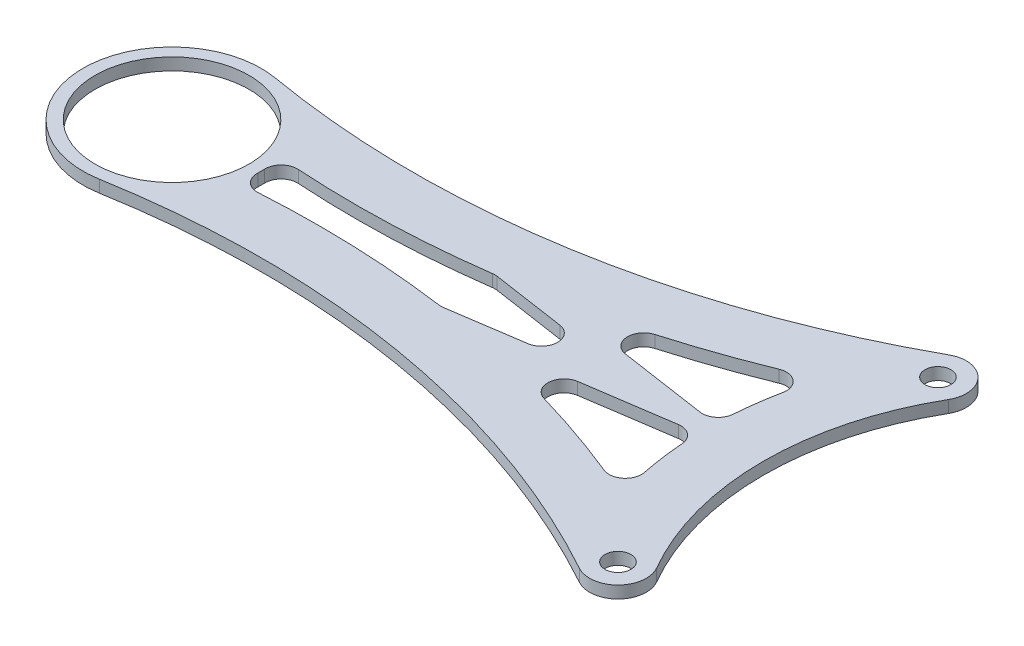
ISO-10303-21;
HEADER;
FILE_DESCRIPTION(('STEP AP214'),'2;1');
FILE_NAME('part.step','',(''),(''),'','','');
FILE_SCHEMA(('AUTOMOTIVE_DESIGN { 1 0 10303 214 1 1 1 1 }'));
ENDSEC;
DATA;
#1=APPLICATION_CONTEXT('core data for automotive mechanical design processes');
#2=APPLICATION_PROTOCOL_DEFINITION('international standard','automotive_design',2000,#1);
#3=PRODUCT_CONTEXT('',#1,'mechanical');
#4=PRODUCT('Part','Part','',(#3));
#5=PRODUCT_RELATED_PRODUCT_CATEGORY('part','',(#4));
#6=PRODUCT_DEFINITION_FORMATION('','',#4);
#7=PRODUCT_DEFINITION_CONTEXT('part definition',#1,'design');
#8=PRODUCT_DEFINITION('design','',#6,#7);
#9=PRODUCT_DEFINITION_SHAPE('','',#8);
#10=(LENGTH_UNIT() NAMED_UNIT(*) SI_UNIT(.MILLI.,.METRE.));
#11=(NAMED_UNIT(*) PLANE_ANGLE_UNIT() SI_UNIT($,.RADIAN.));
#12=(NAMED_UNIT(*) SI_UNIT($,.STERADIAN.) SOLID_ANGLE_UNIT());
#13=UNCERTAINTY_MEASURE_WITH_UNIT(LENGTH_MEASURE(1.E-05),#10,'distance_accuracy_value','');
#14=(GEOMETRIC_REPRESENTATION_CONTEXT(3) GLOBAL_UNCERTAINTY_ASSIGNED_CONTEXT((#13)) GLOBAL_UNIT_ASSIGNED_CONTEXT((#10,
#11,#12)) REPRESENTATION_CONTEXT('',''));
#15=CARTESIAN_POINT('',(0.,0.,0.));
#16=DIRECTION('',(0.,0.,1.));
#17=DIRECTION('',(1.,0.,0.));
#18=AXIS2_PLACEMENT_3D('',#15,#16,#17);
#19=CARTESIAN_POINT('',(0.,0.75,0.));
#20=DIRECTION('',(0.,1.,0.));
#21=DIRECTION('',(0.,0.,1.));
#22=AXIS2_PLACEMENT_3D('',#19,#20,#21);
#23=PLANE('',#22);
#24=CARTESIAN_POINT('',(-109.,0.75,0.));
#25=DIRECTION('',(0.,1.,0.));
#26=DIRECTION('',(0.,0.,1.));
#27=AXIS2_PLACEMENT_3D('',#24,#25,#26);
#28=CIRCLE('',#27,9.49999999999999);
#29=CARTESIAN_POINT('',(-109.,0.75,9.50000000000002));
#30=VERTEX_POINT('',#29);
#31=EDGE_CURVE('E789',#30,#30,#28,.T.);
#32=ORIENTED_EDGE('',*,*,#31,.F.);
#33=EDGE_LOOP('',(#32));
#34=FACE_BOUND('',#33,.T.);
#35=DIRECTION('',(-0.989134239046826,0.,-0.147015159576339));
#36=VECTOR('',#35,1.);
#37=CARTESIAN_POINT('',(-0.782363497669689,0.75,5.26382806477644));
#38=LINE('',#37,#36);
#39=CARTESIAN_POINT('',(-45.1719776825577,0.75,-1.33380646783477));
#40=VERTEX_POINT('',#39);
#41=CARTESIAN_POINT('',(-55.9833992617867,0.75,-2.94070956144224));
#42=VERTEX_POINT('',#41);
#43=EDGE_CURVE('E454',#40,#42,#38,.T.);
#44=ORIENTED_EDGE('',*,*,#43,.T.);
#45=CARTESIAN_POINT('',(-55.689368942634,0.75,-4.91897803953589));
#46=DIRECTION('',(0.,1.,0.));
#47=DIRECTION('',(0.,0.,1.));
#48=AXIS2_PLACEMENT_3D('',#45,#46,#47);
#49=CIRCLE('',#48,2.);
#50=CARTESIAN_POINT('',(-56.2465663827674,0.75,-6.83979323437083));
#51=VERTEX_POINT('',#50);
#52=EDGE_CURVE('E405',#42,#51,#49,.F.);
#53=ORIENTED_EDGE('',*,*,#52,.T.);
#54=CARTESIAN_POINT('',(-88.5640179105055,0.75,-118.247074534797));
#55=DIRECTION('',(0.,1.,0.));
#56=DIRECTION('',(0.,0.,1.));
#57=AXIS2_PLACEMENT_3D('',#54,#55,#56);
#58=CIRCLE('',#57,116.);
#59=CARTESIAN_POINT('',(-44.855784822336,0.75,-10.7966656928096));
#60=VERTEX_POINT('',#59);
#61=EDGE_CURVE('E821',#51,#60,#58,.T.);
#62=ORIENTED_EDGE('',*,*,#61,.T.);
#63=CARTESIAN_POINT('',(-44.1021945966779,0.75,-8.9440724369133));
#64=DIRECTION('',(0.,1.,0.));
#65=DIRECTION('',(0.,0.,1.));
#66=AXIS2_PLACEMENT_3D('',#63,#64,#65);
#67=CIRCLE('',#66,2.);
#68=CARTESIAN_POINT('',(-42.1420970590478,0.75,-8.54655810638382));
#69=VERTEX_POINT('',#68);
#70=EDGE_CURVE('E397',#60,#69,#67,.F.);
#71=ORIENTED_EDGE('',*,*,#70,.T.);
#72=CARTESIAN_POINT('',(0.,0.75,0.));
#73=DIRECTION('',(0.,1.,0.));
#74=DIRECTION('',(0.,0.,1.));
#75=AXIS2_PLACEMENT_3D('',#72,#73,#74);
#76=CIRCLE('',#75,43.);
#77=CARTESIAN_POINT('',(-42.8833719250315,0.75,-3.16487161499827));
#78=VERTEX_POINT('',#77);
#79=EDGE_CURVE('E804',#69,#78,#76,.T.);
#80=ORIENTED_EDGE('',*,*,#79,.T.);
#81=CARTESIAN_POINT('',(-44.877947363405,0.75,-3.31207494592842));
#82=DIRECTION('',(0.,1.,0.));
#83=DIRECTION('',(0.,0.,1.));
#84=AXIS2_PLACEMENT_3D('',#81,#82,#83);
#85=CIRCLE('',#84,2.);
#86=EDGE_CURVE('E393',#78,#40,#85,.F.);
#87=ORIENTED_EDGE('',*,*,#86,.T.);
#88=EDGE_LOOP('',(#44,#53,#62,#71,#80,#87));
#89=FACE_BOUND('',#88,.T.);
#90=CARTESIAN_POINT('',(0.,0.75,0.));
#91=DIRECTION('',(0.,1.,0.));
#92=DIRECTION('',(0.,0.,1.));
#93=AXIS2_PLACEMENT_3D('',#90,#91,#92);
#94=CIRCLE('',#93,36.);
#95=CARTESIAN_POINT('',(-31.1769145362398,0.75,-18.));
#96=VERTEX_POINT('',#95);
#97=CARTESIAN_POINT('',(-31.1769145362398,0.75,18.));
#98=VERTEX_POINT('',#97);
#99=EDGE_CURVE('E280',#96,#98,#94,.T.);
#100=ORIENTED_EDGE('',*,*,#99,.F.);
#101=CARTESIAN_POINT('',(-34.2080034494853,0.75,-19.75));
#102=DIRECTION('',(0.,1.,0.));
#103=DIRECTION('',(0.,0.,1.));
#104=AXIS2_PLACEMENT_3D('',#101,#102,#103);
#105=CIRCLE('',#104,3.5);
#106=CARTESIAN_POINT('',(-35.8990794549393,0.75,-22.8143534299715));
#107=VERTEX_POINT('',#106);
#108=EDGE_CURVE('E290',#96,#107,#105,.T.);
#109=ORIENTED_EDGE('',*,*,#108,.T.);
#110=CARTESIAN_POINT('',(-88.5640179105055,0.75,-118.247074534797));
#111=DIRECTION('',(0.,1.,0.));
#112=DIRECTION('',(0.,0.,1.));
#113=AXIS2_PLACEMENT_3D('',#110,#111,#112);
#114=CIRCLE('',#113,109.);
#115=CARTESIAN_POINT('',(-107.126701641796,0.75,-10.8393151656897));
#116=VERTEX_POINT('',#115);
#117=EDGE_CURVE('E295',#116,#107,#114,.T.);
#118=ORIENTED_EDGE('',*,*,#117,.F.);
#119=CARTESIAN_POINT('',(-109.,0.75,0.));
#120=DIRECTION('',(0.,1.,0.));
#121=DIRECTION('',(0.,0.,1.));
#122=AXIS2_PLACEMENT_3D('',#119,#120,#121);
#123=CIRCLE('',#122,11.);
#124=CARTESIAN_POINT('',(-107.126701641796,0.75,10.8393151656897));
#125=VERTEX_POINT('',#124);
#126=EDGE_CURVE('E311',#116,#125,#123,.T.);
#127=ORIENTED_EDGE('',*,*,#126,.T.);
#128=CARTESIAN_POINT('',(-88.5640179105054,0.75,118.247074534797));
#129=DIRECTION('',(0.,1.,0.));
#130=DIRECTION('',(0.,0.,1.));
#131=AXIS2_PLACEMENT_3D('',#128,#129,#130);
#132=CIRCLE('',#131,109.);
#133=CARTESIAN_POINT('',(-35.8990794549393,0.75,22.8143534299715));
#134=VERTEX_POINT('',#133);
#135=EDGE_CURVE('E313',#125,#134,#132,.F.);
#136=ORIENTED_EDGE('',*,*,#135,.T.);
#137=CARTESIAN_POINT('',(-34.2080034494853,0.75,19.7500000000001));
#138=DIRECTION('',(0.,1.,0.));
#139=DIRECTION('',(0.,0.,1.));
#140=AXIS2_PLACEMENT_3D('',#137,#138,#139);
#141=CIRCLE('',#140,3.5);
#142=EDGE_CURVE('E299',#134,#98,#141,.T.);
#143=ORIENTED_EDGE('',*,*,#142,.T.);
#144=EDGE_LOOP('',(#100,#109,#118,#127,#136,#143));
#145=FACE_BOUND('',#144,.T.);
#146=CARTESIAN_POINT('',(-34.2080034494853,0.75,19.7500000000001));
#147=DIRECTION('',(0.,1.,0.));
#148=DIRECTION('',(0.,0.,1.));
#149=AXIS2_PLACEMENT_3D('',#146,#147,#148);
#150=CIRCLE('',#149,1.6);
#151=CARTESIAN_POINT('',(-34.2080034494853,0.75,21.3500000000001));
#152=VERTEX_POINT('',#151);
#153=EDGE_CURVE('E478',#152,#152,#150,.T.);
#154=ORIENTED_EDGE('',*,*,#153,.F.);
#155=EDGE_LOOP('',(#154));
#156=FACE_BOUND('',#155,.T.);
#157=CARTESIAN_POINT('',(-34.2080034494853,0.75,-19.75));
#158=DIRECTION('',(0.,1.,0.));
#159=DIRECTION('',(0.,0.,1.));
#160=AXIS2_PLACEMENT_3D('',#157,#158,#159);
#161=CIRCLE('',#160,1.6);
#162=CARTESIAN_POINT('',(-34.2080034494853,0.75,-18.15));
#163=VERTEX_POINT('',#162);
#164=EDGE_CURVE('E464',#163,#163,#161,.T.);
#165=ORIENTED_EDGE('',*,*,#164,.F.);
#166=EDGE_LOOP('',(#165));
#167=FACE_BOUND('',#166,.T.);
#168=DIRECTION('',(-0.989134239046826,0.,0.147015159576342));
#169=VECTOR('',#168,1.);
#170=CARTESIAN_POINT('',(-1.0763938168224,0.75,-7.24209654287021));
#171=LINE('',#170,#169);
#172=CARTESIAN_POINT('',(-63.1120285433839,0.75,1.97826847809369));
#173=VERTEX_POINT('',#172);
#174=CARTESIAN_POINT('',(-72.1849936818319,0.75,3.32678454902142));
#175=VERTEX_POINT('',#174);
#176=EDGE_CURVE('E470',#173,#175,#171,.T.);
#177=ORIENTED_EDGE('',*,*,#176,.T.);
#178=CARTESIAN_POINT('',(-72.4790240009846,0.75,1.34851607092778));
#179=DIRECTION('',(0.,1.,0.));
#180=DIRECTION('',(0.,0.,1.));
#181=AXIS2_PLACEMENT_3D('',#178,#179,#180);
#182=CIRCLE('',#181,2.);
#183=CARTESIAN_POINT('',(-72.7516510164002,0.75,3.3298475703154));
#184=VERTEX_POINT('',#183);
#185=EDGE_CURVE('E417',#175,#184,#182,.F.);
#186=ORIENTED_EDGE('',*,*,#185,.T.);
#187=CARTESIAN_POINT('',(-88.5640179105054,0.75,118.247074534797));
#188=DIRECTION('',(0.,1.,0.));
#189=DIRECTION('',(0.,0.,1.));
#190=AXIS2_PLACEMENT_3D('',#187,#188,#189);
#191=CIRCLE('',#190,116.);
#192=CARTESIAN_POINT('',(-95.8827596665104,0.75,2.47818398509501));
#193=VERTEX_POINT('',#192);
#194=EDGE_CURVE('E466',#184,#193,#191,.T.);
#195=ORIENTED_EDGE('',*,*,#194,.T.);
#196=CARTESIAN_POINT('',(-96.0089448692001,0.75,0.482168630789784));
#197=DIRECTION('',(0.,1.,0.));
#198=DIRECTION('',(0.,0.,1.));
#199=AXIS2_PLACEMENT_3D('',#196,#197,#198);
#200=CIRCLE('',#199,2.);
#201=CARTESIAN_POINT('',(-98.007568735477,0.75,0.407988841437514));
#202=VERTEX_POINT('',#201);
#203=EDGE_CURVE('E425',#193,#202,#200,.F.);
#204=ORIENTED_EDGE('',*,*,#203,.T.);
#205=CARTESIAN_POINT('',(-109.,0.75,0.));
#206=DIRECTION('',(0.,1.,0.));
#207=DIRECTION('',(0.,0.,1.));
#208=AXIS2_PLACEMENT_3D('',#205,#206,#207);
#209=CIRCLE('',#208,11.);
#210=CARTESIAN_POINT('',(-98.007568735477,0.75,-0.407988841437441));
#211=VERTEX_POINT('',#210);
#212=EDGE_CURVE('E435',#202,#211,#209,.T.);
#213=ORIENTED_EDGE('',*,*,#212,.T.);
#214=CARTESIAN_POINT('',(-96.0089448692001,0.75,-0.482168630789707));
#215=DIRECTION('',(0.,1.,0.));
#216=DIRECTION('',(0.,0.,1.));
#217=AXIS2_PLACEMENT_3D('',#214,#215,#216);
#218=CIRCLE('',#217,2.);
#219=CARTESIAN_POINT('',(-95.8827596665104,0.75,-2.47818398509493));
#220=VERTEX_POINT('',#219);
#221=EDGE_CURVE('E99',#211,#220,#218,.F.);
#222=ORIENTED_EDGE('',*,*,#221,.T.);
#223=CARTESIAN_POINT('',(-88.5640179105055,0.75,-118.247074534797));
#224=DIRECTION('',(0.,1.,0.));
#225=DIRECTION('',(0.,0.,1.));
#226=AXIS2_PLACEMENT_3D('',#223,#224,#225);
#227=CIRCLE('',#226,116.);
#228=CARTESIAN_POINT('',(-72.7516510164005,0.75,-3.32984757031531));
#229=VERTEX_POINT('',#228);
#230=EDGE_CURVE('E434',#220,#229,#227,.T.);
#231=ORIENTED_EDGE('',*,*,#230,.T.);
#232=CARTESIAN_POINT('',(-72.4790240009849,0.75,-1.34851607092769));
#233=DIRECTION('',(0.,1.,0.));
#234=DIRECTION('',(0.,0.,1.));
#235=AXIS2_PLACEMENT_3D('',#232,#233,#234);
#236=CIRCLE('',#235,2.);
#237=CARTESIAN_POINT('',(-72.1849936818323,0.75,-3.32678454902137));
#238=VERTEX_POINT('',#237);
#239=EDGE_CURVE('E421',#229,#238,#236,.F.);
#240=ORIENTED_EDGE('',*,*,#239,.T.);
#241=DIRECTION('',(-0.989134239046826,0.,-0.147015159576338));
#242=VECTOR('',#241,1.);
#243=CARTESIAN_POINT('',(-1.07639381682235,0.75,7.24209654287005));
#244=LINE('',#243,#242);
#245=CARTESIAN_POINT('',(-63.1120285433839,0.75,-1.97826847809362));
#246=VERTEX_POINT('',#245);
#247=EDGE_CURVE('E444',#246,#238,#244,.T.);
#248=ORIENTED_EDGE('',*,*,#247,.F.);
#249=CARTESIAN_POINT('',(-63.4060588625366,0.75,0.));
#250=DIRECTION('',(0.,1.,0.));
#251=DIRECTION('',(0.,0.,1.));
#252=AXIS2_PLACEMENT_3D('',#249,#250,#251);
#253=CIRCLE('',#252,2.);
#254=EDGE_CURVE('E413',#246,#173,#253,.F.);
#255=ORIENTED_EDGE('',*,*,#254,.T.);
#256=EDGE_LOOP('',(#177,#186,#195,#204,#213,#222,#231,#240,#248,#255));
#257=FACE_BOUND('',#256,.T.);
#258=DIRECTION('',(-0.989134239046826,0.,0.147015159576342));
#259=VECTOR('',#258,1.);
#260=CARTESIAN_POINT('',(-0.782363497669724,0.75,-5.26382806477657));
#261=LINE('',#260,#259);
#262=CARTESIAN_POINT('',(-45.1719776825578,0.75,1.33380646783476));
#263=VERTEX_POINT('',#262);
#264=CARTESIAN_POINT('',(-55.9833992617867,0.75,2.94070956144228));
#265=VERTEX_POINT('',#264);
#266=EDGE_CURVE('E807',#263,#265,#261,.T.);
#267=ORIENTED_EDGE('',*,*,#266,.F.);
#268=CARTESIAN_POINT('',(-44.877947363405,0.75,3.31207494592841));
#269=DIRECTION('',(0.,1.,0.));
#270=DIRECTION('',(0.,0.,1.));
#271=AXIS2_PLACEMENT_3D('',#268,#269,#270);
#272=CIRCLE('',#271,2.);
#273=CARTESIAN_POINT('',(-42.8833719250315,0.75,3.16487161499826));
#274=VERTEX_POINT('',#273);
#275=EDGE_CURVE('E401',#263,#274,#272,.F.);
#276=ORIENTED_EDGE('',*,*,#275,.T.);
#277=CARTESIAN_POINT('',(0.,0.75,0.));
#278=DIRECTION('',(0.,1.,0.));
#279=DIRECTION('',(0.,0.,1.));
#280=AXIS2_PLACEMENT_3D('',#277,#278,#279);
#281=CIRCLE('',#280,43.);
#282=CARTESIAN_POINT('',(-42.1420970590478,0.75,8.54655810638387));
#283=VERTEX_POINT('',#282);
#284=EDGE_CURVE('E791',#274,#283,#281,.T.);
#285=ORIENTED_EDGE('',*,*,#284,.T.);
#286=CARTESIAN_POINT('',(-44.1021945966779,0.75,8.94407243691335));
#287=DIRECTION('',(0.,1.,0.));
#288=DIRECTION('',(0.,0.,1.));
#289=AXIS2_PLACEMENT_3D('',#286,#287,#288);
#290=CIRCLE('',#289,2.);
#291=CARTESIAN_POINT('',(-44.855784822336,0.75,10.7966656928097));
#292=VERTEX_POINT('',#291);
#293=EDGE_CURVE('E389',#283,#292,#290,.F.);
#294=ORIENTED_EDGE('',*,*,#293,.T.);
#295=CARTESIAN_POINT('',(-88.5640179105054,0.75,118.247074534797));
#296=DIRECTION('',(0.,1.,0.));
#297=DIRECTION('',(0.,0.,1.));
#298=AXIS2_PLACEMENT_3D('',#295,#296,#297);
#299=CIRCLE('',#298,116.);
#300=CARTESIAN_POINT('',(-56.2465663827674,0.75,6.83979323437087));
#301=VERTEX_POINT('',#300);
#302=EDGE_CURVE('E798',#292,#301,#299,.T.);
#303=ORIENTED_EDGE('',*,*,#302,.T.);
#304=CARTESIAN_POINT('',(-55.689368942634,0.75,4.91897803953593));
#305=DIRECTION('',(0.,1.,0.));
#306=DIRECTION('',(0.,0.,1.));
#307=AXIS2_PLACEMENT_3D('',#304,#305,#306);
#308=CIRCLE('',#307,2.);
#309=EDGE_CURVE('E409',#301,#265,#308,.F.);
#310=ORIENTED_EDGE('',*,*,#309,.T.);
#311=EDGE_LOOP('',(#267,#276,#285,#294,#303,#310));
#312=FACE_BOUND('',#311,.T.);
#313=ADVANCED_FACE('F91',(#34,#89,#145,#156,#167,#257,#312),#23,.T.);
#314=CARTESIAN_POINT('',(0.,-0.75,0.));
#315=DIRECTION('',(0.,1.,0.));
#316=DIRECTION('',(0.,0.,1.));
#317=AXIS2_PLACEMENT_3D('',#314,#315,#316);
#318=PLANE('',#317);
#319=CARTESIAN_POINT('',(-109.,-0.75,0.));
#320=DIRECTION('',(0.,1.,0.));
#321=DIRECTION('',(0.,0.,1.));
#322=AXIS2_PLACEMENT_3D('',#319,#320,#321);
#323=CIRCLE('',#322,9.49999999999999);
#324=CARTESIAN_POINT('',(-109.,-0.75,9.50000000000002));
#325=VERTEX_POINT('',#324);
#326=EDGE_CURVE('E787',#325,#325,#323,.T.);
#327=ORIENTED_EDGE('',*,*,#326,.T.);
#328=EDGE_LOOP('',(#327));
#329=FACE_BOUND('',#328,.T.);
#330=CARTESIAN_POINT('',(0.,-0.75,0.));
#331=DIRECTION('',(0.,1.,0.));
#332=DIRECTION('',(0.,0.,1.));
#333=AXIS2_PLACEMENT_3D('',#330,#331,#332);
#334=CIRCLE('',#333,43.);
#335=CARTESIAN_POINT('',(-42.1420970590478,-0.75,-8.54655810638382));
#336=VERTEX_POINT('',#335);
#337=CARTESIAN_POINT('',(-42.8833719250315,-0.75,-3.16487161499827));
#338=VERTEX_POINT('',#337);
#339=EDGE_CURVE('E812',#336,#338,#334,.T.);
#340=ORIENTED_EDGE('',*,*,#339,.F.);
#341=CARTESIAN_POINT('',(-44.1021945966779,-0.75,-8.9440724369133));
#342=DIRECTION('',(0.,1.,0.));
#343=DIRECTION('',(0.,0.,1.));
#344=AXIS2_PLACEMENT_3D('',#341,#342,#343);
#345=CIRCLE('',#344,2.);
#346=CARTESIAN_POINT('',(-44.855784822336,-0.75,-10.7966656928096));
#347=VERTEX_POINT('',#346);
#348=EDGE_CURVE('E399',#336,#347,#345,.T.);
#349=ORIENTED_EDGE('',*,*,#348,.T.);
#350=CARTESIAN_POINT('',(-88.5640179105055,-0.75,-118.247074534797));
#351=DIRECTION('',(0.,1.,0.));
#352=DIRECTION('',(0.,0.,1.));
#353=AXIS2_PLACEMENT_3D('',#350,#351,#352);
#354=CIRCLE('',#353,116.);
#355=CARTESIAN_POINT('',(-56.2465663827674,-0.75,-6.83979323437083));
#356=VERTEX_POINT('',#355);
#357=EDGE_CURVE('E815',#356,#347,#354,.T.);
#358=ORIENTED_EDGE('',*,*,#357,.F.);
#359=CARTESIAN_POINT('',(-55.689368942634,-0.75,-4.91897803953589));
#360=DIRECTION('',(0.,1.,0.));
#361=DIRECTION('',(0.,0.,1.));
#362=AXIS2_PLACEMENT_3D('',#359,#360,#361);
#363=CIRCLE('',#362,2.);
#364=CARTESIAN_POINT('',(-55.9833992617867,-0.75,-2.94070956144224));
#365=VERTEX_POINT('',#364);
#366=EDGE_CURVE('E407',#356,#365,#363,.T.);
#367=ORIENTED_EDGE('',*,*,#366,.T.);
#368=DIRECTION('',(-0.989134239046826,0.,-0.147015159576339));
#369=VECTOR('',#368,1.);
#370=CARTESIAN_POINT('',(-0.782363497669689,-0.75,5.26382806477644));
#371=LINE('',#370,#369);
#372=CARTESIAN_POINT('',(-45.1719776825577,-0.75,-1.33380646783477));
#373=VERTEX_POINT('',#372);
#374=EDGE_CURVE('E467',#373,#365,#371,.T.);
#375=ORIENTED_EDGE('',*,*,#374,.F.);
#376=CARTESIAN_POINT('',(-44.877947363405,-0.75,-3.31207494592842));
#377=DIRECTION('',(0.,1.,0.));
#378=DIRECTION('',(0.,0.,1.));
#379=AXIS2_PLACEMENT_3D('',#376,#377,#378);
#380=CIRCLE('',#379,2.);
#381=EDGE_CURVE('E395',#373,#338,#380,.T.);
#382=ORIENTED_EDGE('',*,*,#381,.T.);
#383=EDGE_LOOP('',(#340,#349,#358,#367,#375,#382));
#384=FACE_BOUND('',#383,.T.);
#385=CARTESIAN_POINT('',(0.,-0.75,0.));
#386=DIRECTION('',(0.,1.,0.));
#387=DIRECTION('',(0.,0.,1.));
#388=AXIS2_PLACEMENT_3D('',#385,#386,#387);
#389=CIRCLE('',#388,36.);
#390=CARTESIAN_POINT('',(-31.1769145362398,-0.75,-18.));
#391=VERTEX_POINT('',#390);
#392=CARTESIAN_POINT('',(-31.1769145362398,-0.75,18.));
#393=VERTEX_POINT('',#392);
#394=EDGE_CURVE('E282',#391,#393,#389,.T.);
#395=ORIENTED_EDGE('',*,*,#394,.T.);
#396=CARTESIAN_POINT('',(-34.2080034494853,-0.75,19.7500000000001));
#397=DIRECTION('',(0.,1.,0.));
#398=DIRECTION('',(0.,0.,1.));
#399=AXIS2_PLACEMENT_3D('',#396,#397,#398);
#400=CIRCLE('',#399,3.5);
#401=CARTESIAN_POINT('',(-35.8990794549393,-0.75,22.8143534299715));
#402=VERTEX_POINT('',#401);
#403=EDGE_CURVE('E301',#402,#393,#400,.T.);
#404=ORIENTED_EDGE('',*,*,#403,.F.);
#405=CARTESIAN_POINT('',(-88.5640179105054,-0.75,118.247074534797));
#406=DIRECTION('',(0.,1.,0.));
#407=DIRECTION('',(0.,0.,1.));
#408=AXIS2_PLACEMENT_3D('',#405,#406,#407);
#409=CIRCLE('',#408,109.);
#410=CARTESIAN_POINT('',(-107.126701641796,-0.75,10.8393151656897));
#411=VERTEX_POINT('',#410);
#412=EDGE_CURVE('E304',#411,#402,#409,.F.);
#413=ORIENTED_EDGE('',*,*,#412,.F.);
#414=CARTESIAN_POINT('',(-109.,-0.75,0.));
#415=DIRECTION('',(0.,1.,0.));
#416=DIRECTION('',(0.,0.,1.));
#417=AXIS2_PLACEMENT_3D('',#414,#415,#416);
#418=CIRCLE('',#417,11.);
#419=CARTESIAN_POINT('',(-107.126701641796,-0.75,-10.8393151656897));
#420=VERTEX_POINT('',#419);
#421=EDGE_CURVE('E323',#420,#411,#418,.T.);
#422=ORIENTED_EDGE('',*,*,#421,.F.);
#423=CARTESIAN_POINT('',(-88.5640179105055,-0.75,-118.247074534797));
#424=DIRECTION('',(0.,1.,0.));
#425=DIRECTION('',(0.,0.,1.));
#426=AXIS2_PLACEMENT_3D('',#423,#424,#425);
#427=CIRCLE('',#426,109.);
#428=CARTESIAN_POINT('',(-35.8990794549393,-0.75,-22.8143534299715));
#429=VERTEX_POINT('',#428);
#430=EDGE_CURVE('E320',#420,#429,#427,.T.);
#431=ORIENTED_EDGE('',*,*,#430,.T.);
#432=CARTESIAN_POINT('',(-34.2080034494853,-0.75,-19.75));
#433=DIRECTION('',(0.,1.,0.));
#434=DIRECTION('',(0.,0.,1.));
#435=AXIS2_PLACEMENT_3D('',#432,#433,#434);
#436=CIRCLE('',#435,3.5);
#437=EDGE_CURVE('E318',#391,#429,#436,.T.);
#438=ORIENTED_EDGE('',*,*,#437,.F.);
#439=EDGE_LOOP('',(#395,#404,#413,#422,#431,#438));
#440=FACE_BOUND('',#439,.T.);
#441=CARTESIAN_POINT('',(-34.2080034494853,-0.75,19.7500000000001));
#442=DIRECTION('',(0.,1.,0.));
#443=DIRECTION('',(0.,0.,1.));
#444=AXIS2_PLACEMENT_3D('',#441,#442,#443);
#445=CIRCLE('',#444,1.6);
#446=CARTESIAN_POINT('',(-34.2080034494853,-0.75,21.3500000000001));
#447=VERTEX_POINT('',#446);
#448=EDGE_CURVE('E307',#447,#447,#445,.T.);
#449=ORIENTED_EDGE('',*,*,#448,.T.);
#450=EDGE_LOOP('',(#449));
#451=FACE_BOUND('',#450,.T.);
#452=CARTESIAN_POINT('',(-34.2080034494853,-0.75,-19.75));
#453=DIRECTION('',(0.,1.,0.));
#454=DIRECTION('',(0.,0.,1.));
#455=AXIS2_PLACEMENT_3D('',#452,#453,#454);
#456=CIRCLE('',#455,1.6);
#457=CARTESIAN_POINT('',(-34.2080034494853,-0.75,-18.15));
#458=VERTEX_POINT('',#457);
#459=EDGE_CURVE('E476',#458,#458,#456,.T.);
#460=ORIENTED_EDGE('',*,*,#459,.T.);
#461=EDGE_LOOP('',(#460));
#462=FACE_BOUND('',#461,.T.);
#463=CARTESIAN_POINT('',(-109.,-0.75,0.));
#464=DIRECTION('',(0.,1.,0.));
#465=DIRECTION('',(0.,0.,1.));
#466=AXIS2_PLACEMENT_3D('',#463,#464,#465);
#467=CIRCLE('',#466,11.);
#468=CARTESIAN_POINT('',(-98.007568735477,-0.75,0.407988841437514));
#469=VERTEX_POINT('',#468);
#470=CARTESIAN_POINT('',(-98.007568735477,-0.75,-0.407988841437441));
#471=VERTEX_POINT('',#470);
#472=EDGE_CURVE('E443',#469,#471,#467,.T.);
#473=ORIENTED_EDGE('',*,*,#472,.F.);
#474=CARTESIAN_POINT('',(-96.0089448692001,-0.75,0.482168630789784));
#475=DIRECTION('',(0.,1.,0.));
#476=DIRECTION('',(0.,0.,1.));
#477=AXIS2_PLACEMENT_3D('',#474,#475,#476);
#478=CIRCLE('',#477,2.);
#479=CARTESIAN_POINT('',(-95.8827596665104,-0.75,2.47818398509501));
#480=VERTEX_POINT('',#479);
#481=EDGE_CURVE('E427',#469,#480,#478,.T.);
#482=ORIENTED_EDGE('',*,*,#481,.T.);
#483=CARTESIAN_POINT('',(-88.5640179105054,-0.75,118.247074534797));
#484=DIRECTION('',(0.,1.,0.));
#485=DIRECTION('',(0.,0.,1.));
#486=AXIS2_PLACEMENT_3D('',#483,#484,#485);
#487=CIRCLE('',#486,116.);
#488=CARTESIAN_POINT('',(-72.7516510164002,-0.75,3.3298475703154));
#489=VERTEX_POINT('',#488);
#490=EDGE_CURVE('E448',#489,#480,#487,.T.);
#491=ORIENTED_EDGE('',*,*,#490,.F.);
#492=CARTESIAN_POINT('',(-72.4790240009846,-0.75,1.34851607092778));
#493=DIRECTION('',(0.,1.,0.));
#494=DIRECTION('',(0.,0.,1.));
#495=AXIS2_PLACEMENT_3D('',#492,#493,#494);
#496=CIRCLE('',#495,2.);
#497=CARTESIAN_POINT('',(-72.1849936818319,-0.75,3.32678454902142));
#498=VERTEX_POINT('',#497);
#499=EDGE_CURVE('E419',#489,#498,#496,.T.);
#500=ORIENTED_EDGE('',*,*,#499,.T.);
#501=DIRECTION('',(-0.989134239046826,0.,0.147015159576342));
#502=VECTOR('',#501,1.);
#503=CARTESIAN_POINT('',(-1.0763938168224,-0.75,-7.24209654287021));
#504=LINE('',#503,#502);
#505=CARTESIAN_POINT('',(-63.1120285433839,-0.75,1.97826847809369));
#506=VERTEX_POINT('',#505);
#507=EDGE_CURVE('E451',#506,#498,#504,.T.);
#508=ORIENTED_EDGE('',*,*,#507,.F.);
#509=CARTESIAN_POINT('',(-63.4060588625366,-0.75,0.));
#510=DIRECTION('',(0.,1.,0.));
#511=DIRECTION('',(0.,0.,1.));
#512=AXIS2_PLACEMENT_3D('',#509,#510,#511);
#513=CIRCLE('',#512,2.);
#514=CARTESIAN_POINT('',(-63.1120285433839,-0.75,-1.97826847809362));
#515=VERTEX_POINT('',#514);
#516=EDGE_CURVE('E415',#506,#515,#513,.T.);
#517=ORIENTED_EDGE('',*,*,#516,.T.);
#518=DIRECTION('',(-0.989134239046826,0.,-0.147015159576338));
#519=VECTOR('',#518,1.);
#520=CARTESIAN_POINT('',(-1.07639381682235,-0.75,7.24209654287005));
#521=LINE('',#520,#519);
#522=CARTESIAN_POINT('',(-72.1849936818323,-0.75,-3.32678454902137));
#523=VERTEX_POINT('',#522);
#524=EDGE_CURVE('E459',#515,#523,#521,.T.);
#525=ORIENTED_EDGE('',*,*,#524,.T.);
#526=CARTESIAN_POINT('',(-72.4790240009849,-0.75,-1.34851607092769));
#527=DIRECTION('',(0.,1.,0.));
#528=DIRECTION('',(0.,0.,1.));
#529=AXIS2_PLACEMENT_3D('',#526,#527,#528);
#530=CIRCLE('',#529,2.);
#531=CARTESIAN_POINT('',(-72.7516510164005,-0.75,-3.32984757031531));
#532=VERTEX_POINT('',#531);
#533=EDGE_CURVE('E423',#523,#532,#530,.T.);
#534=ORIENTED_EDGE('',*,*,#533,.T.);
#535=CARTESIAN_POINT('',(-88.5640179105055,-0.75,-118.247074534797));
#536=DIRECTION('',(0.,1.,0.));
#537=DIRECTION('',(0.,0.,1.));
#538=AXIS2_PLACEMENT_3D('',#535,#536,#537);
#539=CIRCLE('',#538,116.);
#540=CARTESIAN_POINT('',(-95.8827596665104,-0.75,-2.47818398509493));
#541=VERTEX_POINT('',#540);
#542=EDGE_CURVE('E462',#541,#532,#539,.T.);
#543=ORIENTED_EDGE('',*,*,#542,.F.);
#544=CARTESIAN_POINT('',(-96.0089448692001,-0.75,-0.482168630789707));
#545=DIRECTION('',(0.,1.,0.));
#546=DIRECTION('',(0.,0.,1.));
#547=AXIS2_PLACEMENT_3D('',#544,#545,#546);
#548=CIRCLE('',#547,2.);
#549=EDGE_CURVE('E12',#541,#471,#548,.T.);
#550=ORIENTED_EDGE('',*,*,#549,.T.);
#551=EDGE_LOOP('',(#473,#482,#491,#500,#508,#517,#525,#534,#543,#550));
#552=FACE_BOUND('',#551,.T.);
#553=CARTESIAN_POINT('',(0.,-0.75,0.));
#554=DIRECTION('',(0.,1.,0.));
#555=DIRECTION('',(0.,0.,1.));
#556=AXIS2_PLACEMENT_3D('',#553,#554,#555);
#557=CIRCLE('',#556,43.);
#558=CARTESIAN_POINT('',(-42.8833719250315,-0.75,3.16487161499826));
#559=VERTEX_POINT('',#558);
#560=CARTESIAN_POINT('',(-42.1420970590478,-0.75,8.54655810638387));
#561=VERTEX_POINT('',#560);
#562=EDGE_CURVE('E794',#559,#561,#557,.T.);
#563=ORIENTED_EDGE('',*,*,#562,.F.);
#564=CARTESIAN_POINT('',(-44.877947363405,-0.75,3.31207494592841));
#565=DIRECTION('',(0.,1.,0.));
#566=DIRECTION('',(0.,0.,1.));
#567=AXIS2_PLACEMENT_3D('',#564,#565,#566);
#568=CIRCLE('',#567,2.);
#569=CARTESIAN_POINT('',(-45.1719776825578,-0.75,1.33380646783476));
#570=VERTEX_POINT('',#569);
#571=EDGE_CURVE('E403',#559,#570,#568,.T.);
#572=ORIENTED_EDGE('',*,*,#571,.T.);
#573=DIRECTION('',(-0.989134239046826,0.,0.147015159576342));
#574=VECTOR('',#573,1.);
#575=CARTESIAN_POINT('',(-0.782363497669724,-0.75,-5.26382806477657));
#576=LINE('',#575,#574);
#577=CARTESIAN_POINT('',(-55.9833992617867,-0.75,2.94070956144228));
#578=VERTEX_POINT('',#577);
#579=EDGE_CURVE('E797',#570,#578,#576,.T.);
#580=ORIENTED_EDGE('',*,*,#579,.T.);
#581=CARTESIAN_POINT('',(-55.689368942634,-0.75,4.91897803953593));
#582=DIRECTION('',(0.,1.,0.));
#583=DIRECTION('',(0.,0.,1.));
#584=AXIS2_PLACEMENT_3D('',#581,#582,#583);
#585=CIRCLE('',#584,2.);
#586=CARTESIAN_POINT('',(-56.2465663827674,-0.75,6.83979323437087));
#587=VERTEX_POINT('',#586);
#588=EDGE_CURVE('E411',#578,#587,#585,.T.);
#589=ORIENTED_EDGE('',*,*,#588,.T.);
#590=CARTESIAN_POINT('',(-88.5640179105054,-0.75,118.247074534797));
#591=DIRECTION('',(0.,1.,0.));
#592=DIRECTION('',(0.,0.,1.));
#593=AXIS2_PLACEMENT_3D('',#590,#591,#592);
#594=CIRCLE('',#593,116.);
#595=CARTESIAN_POINT('',(-44.855784822336,-0.75,10.7966656928097));
#596=VERTEX_POINT('',#595);
#597=EDGE_CURVE('E801',#596,#587,#594,.T.);
#598=ORIENTED_EDGE('',*,*,#597,.F.);
#599=CARTESIAN_POINT('',(-44.1021945966779,-0.75,8.94407243691335));
#600=DIRECTION('',(0.,1.,0.));
#601=DIRECTION('',(0.,0.,1.));
#602=AXIS2_PLACEMENT_3D('',#599,#600,#601);
#603=CIRCLE('',#602,2.);
#604=EDGE_CURVE('E391',#596,#561,#603,.T.);
#605=ORIENTED_EDGE('',*,*,#604,.T.);
#606=EDGE_LOOP('',(#563,#572,#580,#589,#598,#605));
#607=FACE_BOUND('',#606,.T.);
#608=ADVANCED_FACE('F485',(#329,#384,#440,#451,#462,#552,#607),#318,.F.);
#609=CARTESIAN_POINT('',(0.,0.75,0.));
#610=DIRECTION('',(0.,-1.,0.));
#611=DIRECTION('',(0.,0.,-1.));
#612=AXIS2_PLACEMENT_3D('',#609,#610,#611);
#613=CYLINDRICAL_SURFACE('',#612,36.);
#614=ORIENTED_EDGE('',*,*,#394,.F.);
#615=DIRECTION('',(0.,-1.,0.));
#616=VECTOR('',#615,1.);
#617=CARTESIAN_POINT('',(-31.1769145362398,0.75,-18.));
#618=LINE('',#617,#616);
#619=EDGE_CURVE('E276',#96,#391,#618,.T.);
#620=ORIENTED_EDGE('',*,*,#619,.F.);
#621=ORIENTED_EDGE('',*,*,#99,.T.);
#622=DIRECTION('',(0.,-1.,0.));
#623=VECTOR('',#622,1.);
#624=CARTESIAN_POINT('',(-31.1769145362398,0.75,18.));
#625=LINE('',#624,#623);
#626=EDGE_CURVE('E316',#98,#393,#625,.T.);
#627=ORIENTED_EDGE('',*,*,#626,.T.);
#628=EDGE_LOOP('',(#614,#620,#621,#627));
#629=FACE_BOUND('',#628,.T.);
#630=ADVANCED_FACE('F278',(#629),#613,.F.);
#631=CARTESIAN_POINT('',(-34.2080034494853,0.75,-19.75));
#632=DIRECTION('',(0.,-1.,0.));
#633=DIRECTION('',(0.,0.,-1.));
#634=AXIS2_PLACEMENT_3D('',#631,#632,#633);
#635=CYLINDRICAL_SURFACE('',#634,3.5);
#636=ORIENTED_EDGE('',*,*,#437,.T.);
#637=DIRECTION('',(0.,-1.,0.));
#638=VECTOR('',#637,1.);
#639=CARTESIAN_POINT('',(-35.8990794549393,0.75,-22.8143534299715));
#640=LINE('',#639,#638);
#641=EDGE_CURVE('E287',#107,#429,#640,.T.);
#642=ORIENTED_EDGE('',*,*,#641,.F.);
#643=ORIENTED_EDGE('',*,*,#108,.F.);
#644=ORIENTED_EDGE('',*,*,#619,.T.);
#645=EDGE_LOOP('',(#636,#642,#643,#644));
#646=FACE_BOUND('',#645,.T.);
#647=ADVANCED_FACE('F291',(#646),#635,.T.);
#648=CARTESIAN_POINT('',(-88.5640179105055,0.75,-118.247074534797));
#649=DIRECTION('',(0.,-1.,0.));
#650=DIRECTION('',(0.,0.,-1.));
#651=AXIS2_PLACEMENT_3D('',#648,#649,#650);
#652=CYLINDRICAL_SURFACE('',#651,109.);
#653=ORIENTED_EDGE('',*,*,#430,.F.);
#654=DIRECTION('',(0.,-1.,0.));
#655=VECTOR('',#654,1.);
#656=CARTESIAN_POINT('',(-107.126701641796,0.75,-10.8393151656897));
#657=LINE('',#656,#655);
#658=EDGE_CURVE('E333',#116,#420,#657,.T.);
#659=ORIENTED_EDGE('',*,*,#658,.F.);
#660=ORIENTED_EDGE('',*,*,#117,.T.);
#661=ORIENTED_EDGE('',*,*,#641,.T.);
#662=EDGE_LOOP('',(#653,#659,#660,#661));
#663=FACE_BOUND('',#662,.T.);
#664=ADVANCED_FACE('F519',(#663),#652,.F.);
#665=CARTESIAN_POINT('',(-109.,0.75,0.));
#666=DIRECTION('',(0.,-1.,0.));
#667=DIRECTION('',(0.,0.,-1.));
#668=AXIS2_PLACEMENT_3D('',#665,#666,#667);
#669=CYLINDRICAL_SURFACE('',#668,11.);
#670=ORIENTED_EDGE('',*,*,#421,.T.);
#671=DIRECTION('',(0.,-1.,0.));
#672=VECTOR('',#671,1.);
#673=CARTESIAN_POINT('',(-107.126701641796,0.75,10.8393151656897));
#674=LINE('',#673,#672);
#675=EDGE_CURVE('E330',#125,#411,#674,.T.);
#676=ORIENTED_EDGE('',*,*,#675,.F.);
#677=ORIENTED_EDGE('',*,*,#126,.F.);
#678=ORIENTED_EDGE('',*,*,#658,.T.);
#679=EDGE_LOOP('',(#670,#676,#677,#678));
#680=FACE_BOUND('',#679,.T.);
#681=ADVANCED_FACE('F515',(#680),#669,.T.);
#682=CARTESIAN_POINT('',(-88.5640179105054,0.75,118.247074534797));
#683=DIRECTION('',(0.,-1.,0.));
#684=DIRECTION('',(0.,0.,-1.));
#685=AXIS2_PLACEMENT_3D('',#682,#683,#684);
#686=CYLINDRICAL_SURFACE('',#685,109.);
#687=ORIENTED_EDGE('',*,*,#412,.T.);
#688=DIRECTION('',(0.,-1.,0.));
#689=VECTOR('',#688,1.);
#690=CARTESIAN_POINT('',(-35.8990794549393,0.75,22.8143534299715));
#691=LINE('',#690,#689);
#692=EDGE_CURVE('E327',#134,#402,#691,.T.);
#693=ORIENTED_EDGE('',*,*,#692,.F.);
#694=ORIENTED_EDGE('',*,*,#135,.F.);
#695=ORIENTED_EDGE('',*,*,#675,.T.);
#696=EDGE_LOOP('',(#687,#693,#694,#695));
#697=FACE_BOUND('',#696,.T.);
#698=ADVANCED_FACE('F499',(#697),#686,.F.);
#699=CARTESIAN_POINT('',(-34.2080034494853,0.75,19.7500000000001));
#700=DIRECTION('',(0.,-1.,0.));
#701=DIRECTION('',(0.,0.,-1.));
#702=AXIS2_PLACEMENT_3D('',#699,#700,#701);
#703=CYLINDRICAL_SURFACE('',#702,3.5);
#704=ORIENTED_EDGE('',*,*,#403,.T.);
#705=ORIENTED_EDGE('',*,*,#626,.F.);
#706=ORIENTED_EDGE('',*,*,#142,.F.);
#707=ORIENTED_EDGE('',*,*,#692,.T.);
#708=EDGE_LOOP('',(#704,#705,#706,#707));
#709=FACE_BOUND('',#708,.T.);
#710=ADVANCED_FACE('F491',(#709),#703,.T.);
#711=CARTESIAN_POINT('',(-34.2080034494853,0.75,19.7500000000001));
#712=DIRECTION('',(0.,1.,0.));
#713=DIRECTION('',(0.,0.,1.));
#714=AXIS2_PLACEMENT_3D('',#711,#712,#713);
#715=CYLINDRICAL_SURFACE('',#714,1.6);
#716=ORIENTED_EDGE('',*,*,#153,.T.);
#717=EDGE_LOOP('',(#716));
#718=FACE_BOUND('',#717,.T.);
#719=ORIENTED_EDGE('',*,*,#448,.F.);
#720=EDGE_LOOP('',(#719));
#721=FACE_BOUND('',#720,.T.);
#722=ADVANCED_FACE('F488',(#718,#721),#715,.F.);
#723=CARTESIAN_POINT('',(-34.2080034494853,0.75,-19.75));
#724=DIRECTION('',(0.,1.,0.));
#725=DIRECTION('',(0.,0.,1.));
#726=AXIS2_PLACEMENT_3D('',#723,#724,#725);
#727=CYLINDRICAL_SURFACE('',#726,1.6);
#728=ORIENTED_EDGE('',*,*,#164,.T.);
#729=EDGE_LOOP('',(#728));
#730=FACE_BOUND('',#729,.T.);
#731=ORIENTED_EDGE('',*,*,#459,.F.);
#732=EDGE_LOOP('',(#731));
#733=FACE_BOUND('',#732,.T.);
#734=ADVANCED_FACE('F490',(#730,#733),#727,.F.);
#735=CARTESIAN_POINT('',(-109.,-0.75,0.));
#736=DIRECTION('',(0.,1.,0.));
#737=DIRECTION('',(0.,0.,1.));
#738=AXIS2_PLACEMENT_3D('',#735,#736,#737);
#739=CYLINDRICAL_SURFACE('',#738,11.);
#740=ORIENTED_EDGE('',*,*,#212,.F.);
#741=DIRECTION('',(0.,1.,0.));
#742=VECTOR('',#741,1.);
#743=CARTESIAN_POINT('',(-98.007568735477,-0.75,0.407988841437514));
#744=LINE('',#743,#742);
#745=EDGE_CURVE('E111',#202,#469,#744,.F.);
#746=ORIENTED_EDGE('',*,*,#745,.T.);
#747=ORIENTED_EDGE('',*,*,#472,.T.);
#748=DIRECTION('',(0.,1.,0.));
#749=VECTOR('',#748,1.);
#750=CARTESIAN_POINT('',(-98.007568735477,-0.75,-0.40798884143744));
#751=LINE('',#750,#749);
#752=EDGE_CURVE('E385',#471,#211,#751,.T.);
#753=ORIENTED_EDGE('',*,*,#752,.T.);
#754=EDGE_LOOP('',(#740,#746,#747,#753));
#755=FACE_BOUND('',#754,.T.);
#756=ADVANCED_FACE('F446',(#755),#739,.T.);
#757=CARTESIAN_POINT('',(-88.5640179105055,-0.75,-118.247074534797));
#758=DIRECTION('',(0.,1.,0.));
#759=DIRECTION('',(0.,0.,1.));
#760=AXIS2_PLACEMENT_3D('',#757,#758,#759);
#761=CYLINDRICAL_SURFACE('',#760,116.);
#762=ORIENTED_EDGE('',*,*,#542,.T.);
#763=DIRECTION('',(0.,1.,0.));
#764=VECTOR('',#763,1.);
#765=CARTESIAN_POINT('',(-72.7516510164005,-0.75,-3.32984757031528));
#766=LINE('',#765,#764);
#767=EDGE_CURVE('E382',#532,#229,#766,.T.);
#768=ORIENTED_EDGE('',*,*,#767,.T.);
#769=ORIENTED_EDGE('',*,*,#230,.F.);
#770=DIRECTION('',(0.,1.,0.));
#771=VECTOR('',#770,1.);
#772=CARTESIAN_POINT('',(-95.8827596665104,-0.75,-2.4781839850949));
#773=LINE('',#772,#771);
#774=EDGE_CURVE('E380',#220,#541,#773,.F.);
#775=ORIENTED_EDGE('',*,*,#774,.T.);
#776=EDGE_LOOP('',(#762,#768,#769,#775));
#777=FACE_BOUND('',#776,.T.);
#778=ADVANCED_FACE('F441',(#777),#761,.T.);
#779=CARTESIAN_POINT('',(-1.07639381682235,-0.75,7.24209654287005));
#780=DIRECTION('',(0.147015159576338,0.,-0.989134239046826));
#781=DIRECTION('',(-0.989134239046826,0.,-0.147015159576338));
#782=AXIS2_PLACEMENT_3D('',#779,#780,#781);
#783=PLANE('',#782);
#784=ORIENTED_EDGE('',*,*,#524,.F.);
#785=DIRECTION('',(0.,1.,0.));
#786=VECTOR('',#785,1.);
#787=CARTESIAN_POINT('',(-63.1120285433839,-0.75,-1.97826847809362));
#788=LINE('',#787,#786);
#789=EDGE_CURVE('E367',#515,#246,#788,.T.);
#790=ORIENTED_EDGE('',*,*,#789,.T.);
#791=ORIENTED_EDGE('',*,*,#247,.T.);
#792=DIRECTION('',(0.,1.,0.));
#793=VECTOR('',#792,1.);
#794=CARTESIAN_POINT('',(-72.1849936818323,-0.75,-3.32678454902137));
#795=LINE('',#794,#793);
#796=EDGE_CURVE('E365',#238,#523,#795,.F.);
#797=ORIENTED_EDGE('',*,*,#796,.T.);
#798=EDGE_LOOP('',(#784,#790,#791,#797));
#799=FACE_BOUND('',#798,.T.);
#800=ADVANCED_FACE('F590',(#799),#783,.F.);
#801=CARTESIAN_POINT('',(-1.0763938168224,-0.75,-7.24209654287021));
#802=DIRECTION('',(-0.147015159576342,0.,-0.989134239046826));
#803=DIRECTION('',(-0.989134239046826,0.,0.147015159576342));
#804=AXIS2_PLACEMENT_3D('',#801,#802,#803);
#805=PLANE('',#804);
#806=ORIENTED_EDGE('',*,*,#176,.F.);
#807=DIRECTION('',(0.,1.,0.));
#808=VECTOR('',#807,1.);
#809=CARTESIAN_POINT('',(-63.1120285433839,-0.75,1.97826847809368));
#810=LINE('',#809,#808);
#811=EDGE_CURVE('E373',#173,#506,#810,.F.);
#812=ORIENTED_EDGE('',*,*,#811,.T.);
#813=ORIENTED_EDGE('',*,*,#507,.T.);
#814=DIRECTION('',(0.,-1.,0.));
#815=VECTOR('',#814,1.);
#816=CARTESIAN_POINT('',(-72.1849936818319,0.75,3.32678454902141));
#817=LINE('',#816,#815);
#818=EDGE_CURVE('E370',#498,#175,#817,.F.);
#819=ORIENTED_EDGE('',*,*,#818,.T.);
#820=EDGE_LOOP('',(#806,#812,#813,#819));
#821=FACE_BOUND('',#820,.T.);
#822=ADVANCED_FACE('F584',(#821),#805,.T.);
#823=CARTESIAN_POINT('',(-88.5640179105054,-0.75,118.247074534797));
#824=DIRECTION('',(0.,1.,0.));
#825=DIRECTION('',(0.,0.,1.));
#826=AXIS2_PLACEMENT_3D('',#823,#824,#825);
#827=CYLINDRICAL_SURFACE('',#826,116.);
#828=ORIENTED_EDGE('',*,*,#194,.F.);
#829=DIRECTION('',(0.,1.,0.));
#830=VECTOR('',#829,1.);
#831=CARTESIAN_POINT('',(-72.7516510164002,-0.75,3.3298475703154));
#832=LINE('',#831,#830);
#833=EDGE_CURVE('E378',#184,#489,#832,.F.);
#834=ORIENTED_EDGE('',*,*,#833,.T.);
#835=ORIENTED_EDGE('',*,*,#490,.T.);
#836=DIRECTION('',(0.,1.,0.));
#837=VECTOR('',#836,1.);
#838=CARTESIAN_POINT('',(-95.8827596665104,-0.75,2.478183985095));
#839=LINE('',#838,#837);
#840=EDGE_CURVE('E375',#480,#193,#839,.T.);
#841=ORIENTED_EDGE('',*,*,#840,.T.);
#842=EDGE_LOOP('',(#828,#834,#835,#841));
#843=FACE_BOUND('',#842,.T.);
#844=ADVANCED_FACE('F577',(#843),#827,.T.);
#845=CARTESIAN_POINT('',(0.,-0.75,0.));
#846=DIRECTION('',(0.,1.,0.));
#847=DIRECTION('',(0.,0.,1.));
#848=AXIS2_PLACEMENT_3D('',#845,#846,#847);
#849=CYLINDRICAL_SURFACE('',#848,43.);
#850=ORIENTED_EDGE('',*,*,#339,.T.);
#851=DIRECTION('',(0.,1.,0.));
#852=VECTOR('',#851,1.);
#853=CARTESIAN_POINT('',(-42.8833719250315,-0.75,-3.16487161499827));
#854=LINE('',#853,#852);
#855=EDGE_CURVE('E347',#338,#78,#854,.T.);
#856=ORIENTED_EDGE('',*,*,#855,.T.);
#857=ORIENTED_EDGE('',*,*,#79,.F.);
#858=DIRECTION('',(0.,1.,0.));
#859=VECTOR('',#858,1.);
#860=CARTESIAN_POINT('',(-42.1420970590478,-0.75,-8.54655810638383));
#861=LINE('',#860,#859);
#862=EDGE_CURVE('E345',#69,#336,#861,.F.);
#863=ORIENTED_EDGE('',*,*,#862,.T.);
#864=EDGE_LOOP('',(#850,#856,#857,#863));
#865=FACE_BOUND('',#864,.T.);
#866=ADVANCED_FACE('F605',(#865),#849,.T.);
#867=CARTESIAN_POINT('',(-0.782363497669689,-0.75,5.26382806477644));
#868=DIRECTION('',(0.147015159576339,0.,-0.989134239046826));
#869=DIRECTION('',(-0.989134239046826,0.,-0.147015159576339));
#870=AXIS2_PLACEMENT_3D('',#867,#868,#869);
#871=PLANE('',#870);
#872=ORIENTED_EDGE('',*,*,#43,.F.);
#873=DIRECTION('',(0.,-1.,0.));
#874=VECTOR('',#873,1.);
#875=CARTESIAN_POINT('',(-45.1719776825577,-0.75,-1.33380646783477));
#876=LINE('',#875,#874);
#877=EDGE_CURVE('E353',#40,#373,#876,.T.);
#878=ORIENTED_EDGE('',*,*,#877,.T.);
#879=ORIENTED_EDGE('',*,*,#374,.T.);
#880=DIRECTION('',(0.,-1.,0.));
#881=VECTOR('',#880,1.);
#882=CARTESIAN_POINT('',(-55.9833992617867,0.75,-2.94070956144224));
#883=LINE('',#882,#881);
#884=EDGE_CURVE('E350',#365,#42,#883,.F.);
#885=ORIENTED_EDGE('',*,*,#884,.T.);
#886=EDGE_LOOP('',(#872,#878,#879,#885));
#887=FACE_BOUND('',#886,.T.);
#888=ADVANCED_FACE('F640',(#887),#871,.T.);
#889=CARTESIAN_POINT('',(-88.5640179105055,-0.75,-118.247074534797));
#890=DIRECTION('',(0.,1.,0.));
#891=DIRECTION('',(0.,0.,1.));
#892=AXIS2_PLACEMENT_3D('',#889,#890,#891);
#893=CYLINDRICAL_SURFACE('',#892,116.);
#894=ORIENTED_EDGE('',*,*,#357,.T.);
#895=DIRECTION('',(0.,1.,0.));
#896=VECTOR('',#895,1.);
#897=CARTESIAN_POINT('',(-44.855784822336,-0.75,-10.7966656928096));
#898=LINE('',#897,#896);
#899=EDGE_CURVE('E357',#347,#60,#898,.T.);
#900=ORIENTED_EDGE('',*,*,#899,.T.);
#901=ORIENTED_EDGE('',*,*,#61,.F.);
#902=DIRECTION('',(0.,1.,0.));
#903=VECTOR('',#902,1.);
#904=CARTESIAN_POINT('',(-56.2465663827674,-0.75,-6.83979323437083));
#905=LINE('',#904,#903);
#906=EDGE_CURVE('E355',#51,#356,#905,.F.);
#907=ORIENTED_EDGE('',*,*,#906,.T.);
#908=EDGE_LOOP('',(#894,#900,#901,#907));
#909=FACE_BOUND('',#908,.T.);
#910=ADVANCED_FACE('F649',(#909),#893,.T.);
#911=CARTESIAN_POINT('',(0.,-0.75,0.));
#912=DIRECTION('',(0.,1.,0.));
#913=DIRECTION('',(0.,0.,1.));
#914=AXIS2_PLACEMENT_3D('',#911,#912,#913);
#915=CYLINDRICAL_SURFACE('',#914,43.);
#916=ORIENTED_EDGE('',*,*,#562,.T.);
#917=DIRECTION('',(0.,1.,0.));
#918=VECTOR('',#917,1.);
#919=CARTESIAN_POINT('',(-42.1420970590478,-0.75,8.54655810638387));
#920=LINE('',#919,#918);
#921=EDGE_CURVE('E337',#561,#283,#920,.T.);
#922=ORIENTED_EDGE('',*,*,#921,.T.);
#923=ORIENTED_EDGE('',*,*,#284,.F.);
#924=DIRECTION('',(0.,1.,0.));
#925=VECTOR('',#924,1.);
#926=CARTESIAN_POINT('',(-42.8833719250315,-0.75,3.16487161499826));
#927=LINE('',#926,#925);
#928=EDGE_CURVE('E286',#274,#559,#927,.F.);
#929=ORIENTED_EDGE('',*,*,#928,.T.);
#930=EDGE_LOOP('',(#916,#922,#923,#929));
#931=FACE_BOUND('',#930,.T.);
#932=ADVANCED_FACE('F659',(#931),#915,.T.);
#933=CARTESIAN_POINT('',(-88.5640179105054,-0.75,118.247074534797));
#934=DIRECTION('',(0.,1.,0.));
#935=DIRECTION('',(0.,0.,1.));
#936=AXIS2_PLACEMENT_3D('',#933,#934,#935);
#937=CYLINDRICAL_SURFACE('',#936,116.);
#938=ORIENTED_EDGE('',*,*,#302,.F.);
#939=DIRECTION('',(0.,1.,0.));
#940=VECTOR('',#939,1.);
#941=CARTESIAN_POINT('',(-44.855784822336,-0.75,10.7966656928097));
#942=LINE('',#941,#940);
#943=EDGE_CURVE('E343',#292,#596,#942,.F.);
#944=ORIENTED_EDGE('',*,*,#943,.T.);
#945=ORIENTED_EDGE('',*,*,#597,.T.);
#946=DIRECTION('',(0.,1.,0.));
#947=VECTOR('',#946,1.);
#948=CARTESIAN_POINT('',(-56.2465663827674,-0.75,6.83979323437087));
#949=LINE('',#948,#947);
#950=EDGE_CURVE('E340',#587,#301,#949,.T.);
#951=ORIENTED_EDGE('',*,*,#950,.T.);
#952=EDGE_LOOP('',(#938,#944,#945,#951));
#953=FACE_BOUND('',#952,.T.);
#954=ADVANCED_FACE('F669',(#953),#937,.T.);
#955=CARTESIAN_POINT('',(-0.782363497669724,-0.75,-5.26382806477657));
#956=DIRECTION('',(-0.147015159576342,0.,-0.989134239046826));
#957=DIRECTION('',(-0.989134239046826,0.,0.147015159576342));
#958=AXIS2_PLACEMENT_3D('',#955,#956,#957);
#959=PLANE('',#958);
#960=ORIENTED_EDGE('',*,*,#579,.F.);
#961=DIRECTION('',(0.,1.,0.));
#962=VECTOR('',#961,1.);
#963=CARTESIAN_POINT('',(-45.1719776825577,-0.75,1.33380646783476));
#964=LINE('',#963,#962);
#965=EDGE_CURVE('E362',#570,#263,#964,.T.);
#966=ORIENTED_EDGE('',*,*,#965,.T.);
#967=ORIENTED_EDGE('',*,*,#266,.T.);
#968=DIRECTION('',(0.,1.,0.));
#969=VECTOR('',#968,1.);
#970=CARTESIAN_POINT('',(-55.9833992617867,-0.75,2.94070956144227));
#971=LINE('',#970,#969);
#972=EDGE_CURVE('E360',#265,#578,#971,.F.);
#973=ORIENTED_EDGE('',*,*,#972,.T.);
#974=EDGE_LOOP('',(#960,#966,#967,#973));
#975=FACE_BOUND('',#974,.T.);
#976=ADVANCED_FACE('F532',(#975),#959,.F.);
#977=CARTESIAN_POINT('',(-44.1021945966779,-0.75,8.94407243691335));
#978=DIRECTION('',(0.,-1.,0.));
#979=DIRECTION('',(0.,0.,-1.));
#980=AXIS2_PLACEMENT_3D('',#977,#978,#979);
#981=CYLINDRICAL_SURFACE('',#980,2.);
#982=ORIENTED_EDGE('',*,*,#604,.F.);
#983=ORIENTED_EDGE('',*,*,#943,.F.);
#984=ORIENTED_EDGE('',*,*,#293,.F.);
#985=ORIENTED_EDGE('',*,*,#921,.F.);
#986=EDGE_LOOP('',(#982,#983,#984,#985));
#987=FACE_BOUND('',#986,.T.);
#988=ADVANCED_FACE('F528',(#987),#981,.F.);
#989=CARTESIAN_POINT('',(-44.877947363405,-0.75,-3.31207494592842));
#990=DIRECTION('',(0.,1.,0.));
#991=DIRECTION('',(0.,0.,1.));
#992=AXIS2_PLACEMENT_3D('',#989,#990,#991);
#993=CYLINDRICAL_SURFACE('',#992,2.);
#994=ORIENTED_EDGE('',*,*,#381,.F.);
#995=ORIENTED_EDGE('',*,*,#877,.F.);
#996=ORIENTED_EDGE('',*,*,#86,.F.);
#997=ORIENTED_EDGE('',*,*,#855,.F.);
#998=EDGE_LOOP('',(#994,#995,#996,#997));
#999=FACE_BOUND('',#998,.T.);
#1000=ADVANCED_FACE('F531',(#999),#993,.F.);
#1001=CARTESIAN_POINT('',(-44.1021945966779,-0.75,-8.9440724369133));
#1002=DIRECTION('',(0.,-1.,0.));
#1003=DIRECTION('',(0.,0.,-1.));
#1004=AXIS2_PLACEMENT_3D('',#1001,#1002,#1003);
#1005=CYLINDRICAL_SURFACE('',#1004,2.);
#1006=ORIENTED_EDGE('',*,*,#348,.F.);
#1007=ORIENTED_EDGE('',*,*,#862,.F.);
#1008=ORIENTED_EDGE('',*,*,#70,.F.);
#1009=ORIENTED_EDGE('',*,*,#899,.F.);
#1010=EDGE_LOOP('',(#1006,#1007,#1008,#1009));
#1011=FACE_BOUND('',#1010,.T.);
#1012=ADVANCED_FACE('F536',(#1011),#1005,.F.);
#1013=CARTESIAN_POINT('',(-44.877947363405,-0.75,3.31207494592841));
#1014=DIRECTION('',(0.,1.,0.));
#1015=DIRECTION('',(0.,0.,1.));
#1016=AXIS2_PLACEMENT_3D('',#1013,#1014,#1015);
#1017=CYLINDRICAL_SURFACE('',#1016,2.);
#1018=ORIENTED_EDGE('',*,*,#571,.F.);
#1019=ORIENTED_EDGE('',*,*,#928,.F.);
#1020=ORIENTED_EDGE('',*,*,#275,.F.);
#1021=ORIENTED_EDGE('',*,*,#965,.F.);
#1022=EDGE_LOOP('',(#1018,#1019,#1020,#1021));
#1023=FACE_BOUND('',#1022,.T.);
#1024=ADVANCED_FACE('F540',(#1023),#1017,.F.);
#1025=CARTESIAN_POINT('',(-55.689368942634,-0.75,-4.91897803953589));
#1026=DIRECTION('',(0.,1.,0.));
#1027=DIRECTION('',(0.,0.,1.));
#1028=AXIS2_PLACEMENT_3D('',#1025,#1026,#1027);
#1029=CYLINDRICAL_SURFACE('',#1028,2.);
#1030=ORIENTED_EDGE('',*,*,#366,.F.);
#1031=ORIENTED_EDGE('',*,*,#906,.F.);
#1032=ORIENTED_EDGE('',*,*,#52,.F.);
#1033=ORIENTED_EDGE('',*,*,#884,.F.);
#1034=EDGE_LOOP('',(#1030,#1031,#1032,#1033));
#1035=FACE_BOUND('',#1034,.T.);
#1036=ADVANCED_FACE('F544',(#1035),#1029,.F.);
#1037=CARTESIAN_POINT('',(-55.689368942634,-0.75,4.91897803953593));
#1038=DIRECTION('',(0.,1.,0.));
#1039=DIRECTION('',(0.,0.,1.));
#1040=AXIS2_PLACEMENT_3D('',#1037,#1038,#1039);
#1041=CYLINDRICAL_SURFACE('',#1040,2.);
#1042=ORIENTED_EDGE('',*,*,#588,.F.);
#1043=ORIENTED_EDGE('',*,*,#972,.F.);
#1044=ORIENTED_EDGE('',*,*,#309,.F.);
#1045=ORIENTED_EDGE('',*,*,#950,.F.);
#1046=EDGE_LOOP('',(#1042,#1043,#1044,#1045));
#1047=FACE_BOUND('',#1046,.T.);
#1048=ADVANCED_FACE('F548',(#1047),#1041,.F.);
#1049=CARTESIAN_POINT('',(-63.4060588625366,-0.75,0.));
#1050=DIRECTION('',(0.,1.,0.));
#1051=DIRECTION('',(0.,0.,1.));
#1052=AXIS2_PLACEMENT_3D('',#1049,#1050,#1051);
#1053=CYLINDRICAL_SURFACE('',#1052,2.);
#1054=ORIENTED_EDGE('',*,*,#516,.F.);
#1055=ORIENTED_EDGE('',*,*,#811,.F.);
#1056=ORIENTED_EDGE('',*,*,#254,.F.);
#1057=ORIENTED_EDGE('',*,*,#789,.F.);
#1058=EDGE_LOOP('',(#1054,#1055,#1056,#1057));
#1059=FACE_BOUND('',#1058,.T.);
#1060=ADVANCED_FACE('F552',(#1059),#1053,.F.);
#1061=CARTESIAN_POINT('',(-72.4790240009846,-0.75,1.34851607092778));
#1062=DIRECTION('',(0.,1.,0.));
#1063=DIRECTION('',(0.,0.,1.));
#1064=AXIS2_PLACEMENT_3D('',#1061,#1062,#1063);
#1065=CYLINDRICAL_SURFACE('',#1064,2.);
#1066=ORIENTED_EDGE('',*,*,#499,.F.);
#1067=ORIENTED_EDGE('',*,*,#833,.F.);
#1068=ORIENTED_EDGE('',*,*,#185,.F.);
#1069=ORIENTED_EDGE('',*,*,#818,.F.);
#1070=EDGE_LOOP('',(#1066,#1067,#1068,#1069));
#1071=FACE_BOUND('',#1070,.T.);
#1072=ADVANCED_FACE('F556',(#1071),#1065,.F.);
#1073=CARTESIAN_POINT('',(-72.4790240009849,-0.75,-1.34851607092769));
#1074=DIRECTION('',(0.,1.,0.));
#1075=DIRECTION('',(0.,0.,1.));
#1076=AXIS2_PLACEMENT_3D('',#1073,#1074,#1075);
#1077=CYLINDRICAL_SURFACE('',#1076,2.);
#1078=ORIENTED_EDGE('',*,*,#533,.F.);
#1079=ORIENTED_EDGE('',*,*,#796,.F.);
#1080=ORIENTED_EDGE('',*,*,#239,.F.);
#1081=ORIENTED_EDGE('',*,*,#767,.F.);
#1082=EDGE_LOOP('',(#1078,#1079,#1080,#1081));
#1083=FACE_BOUND('',#1082,.T.);
#1084=ADVANCED_FACE('F560',(#1083),#1077,.F.);
#1085=CARTESIAN_POINT('',(-96.0089448692001,-0.75,0.482168630789784));
#1086=DIRECTION('',(0.,-1.,0.));
#1087=DIRECTION('',(0.,0.,-1.));
#1088=AXIS2_PLACEMENT_3D('',#1085,#1086,#1087);
#1089=CYLINDRICAL_SURFACE('',#1088,2.);
#1090=ORIENTED_EDGE('',*,*,#481,.F.);
#1091=ORIENTED_EDGE('',*,*,#745,.F.);
#1092=ORIENTED_EDGE('',*,*,#203,.F.);
#1093=ORIENTED_EDGE('',*,*,#840,.F.);
#1094=EDGE_LOOP('',(#1090,#1091,#1092,#1093));
#1095=FACE_BOUND('',#1094,.T.);
#1096=ADVANCED_FACE('F563',(#1095),#1089,.F.);
#1097=CARTESIAN_POINT('',(-96.0089448692001,-0.75,-0.482168630789707));
#1098=DIRECTION('',(0.,-1.,0.));
#1099=DIRECTION('',(0.,0.,-1.));
#1100=AXIS2_PLACEMENT_3D('',#1097,#1098,#1099);
#1101=CYLINDRICAL_SURFACE('',#1100,2.);
#1102=ORIENTED_EDGE('',*,*,#549,.F.);
#1103=ORIENTED_EDGE('',*,*,#774,.F.);
#1104=ORIENTED_EDGE('',*,*,#221,.F.);
#1105=ORIENTED_EDGE('',*,*,#752,.F.);
#1106=EDGE_LOOP('',(#1102,#1103,#1104,#1105));
#1107=FACE_BOUND('',#1106,.T.);
#1108=ADVANCED_FACE('F93',(#1107),#1101,.F.);
#1109=CARTESIAN_POINT('',(-109.,-0.75,0.));
#1110=DIRECTION('',(0.,1.,0.));
#1111=DIRECTION('',(0.,0.,1.));
#1112=AXIS2_PLACEMENT_3D('',#1109,#1110,#1111);
#1113=CYLINDRICAL_SURFACE('',#1112,9.49999999999999);
#1114=ORIENTED_EDGE('',*,*,#326,.F.);
#1115=EDGE_LOOP('',(#1114));
#1116=FACE_BOUND('',#1115,.T.);
#1117=ORIENTED_EDGE('',*,*,#31,.T.);
#1118=EDGE_LOOP('',(#1117));
#1119=FACE_BOUND('',#1118,.T.);
#1120=ADVANCED_FACE('F570',(#1116,#1119),#1113,.F.);
#1121=CLOSED_SHELL('',(#313,#608,#630,#647,#664,#681,#698,#710,#722,#734,#756,#778,#800,#822,
#844,#866,#888,#910,#932,#954,#976,#988,#1000,#1012,#1024,#1036,#1048,#1060,#1072,#1084,#1096,
#1108,#1120));
#1122=MANIFOLD_SOLID_BREP('B2',#1121);
#1123=ADVANCED_BREP_SHAPE_REPRESENTATION('',(#18,#1122),#14);
#1124=SHAPE_DEFINITION_REPRESENTATION(#9,#1123);
ENDSEC;
END-ISO-10303-21;
